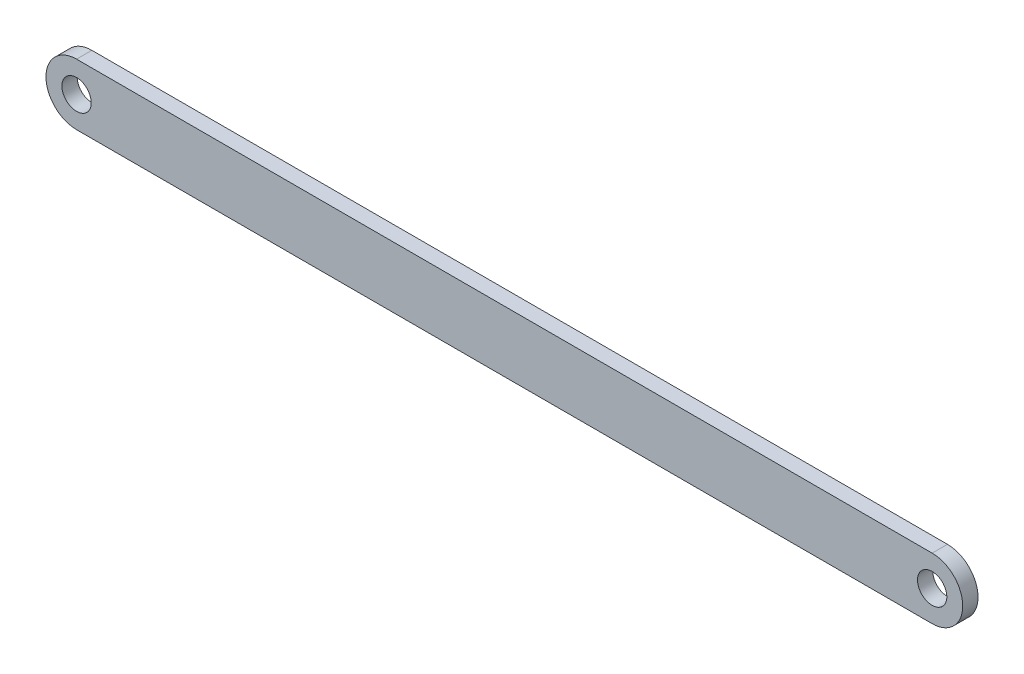
ISO-10303-21;
HEADER;
FILE_DESCRIPTION(('STEP AP214'),'2;1');
FILE_NAME('part.step','',(''),(''),'','','');
FILE_SCHEMA(('AUTOMOTIVE_DESIGN { 1 0 10303 214 1 1 1 1 }'));
ENDSEC;
DATA;
#1=APPLICATION_CONTEXT('core data for automotive mechanical design processes');
#2=APPLICATION_PROTOCOL_DEFINITION('international standard','automotive_design',2000,#1);
#3=PRODUCT_CONTEXT('',#1,'mechanical');
#4=PRODUCT('Part','Part','',(#3));
#5=PRODUCT_RELATED_PRODUCT_CATEGORY('part','',(#4));
#6=PRODUCT_DEFINITION_FORMATION('','',#4);
#7=PRODUCT_DEFINITION_CONTEXT('part definition',#1,'design');
#8=PRODUCT_DEFINITION('design','',#6,#7);
#9=PRODUCT_DEFINITION_SHAPE('','',#8);
#10=(LENGTH_UNIT() NAMED_UNIT(*) SI_UNIT(.MILLI.,.METRE.));
#11=(NAMED_UNIT(*) PLANE_ANGLE_UNIT() SI_UNIT($,.RADIAN.));
#12=(NAMED_UNIT(*) SI_UNIT($,.STERADIAN.) SOLID_ANGLE_UNIT());
#13=UNCERTAINTY_MEASURE_WITH_UNIT(LENGTH_MEASURE(1.E-05),#10,'distance_accuracy_value','');
#14=(GEOMETRIC_REPRESENTATION_CONTEXT(3) GLOBAL_UNCERTAINTY_ASSIGNED_CONTEXT((#13)) GLOBAL_UNIT_ASSIGNED_CONTEXT((#10,
#11,#12)) REPRESENTATION_CONTEXT('',''));
#15=CARTESIAN_POINT('',(0.,0.,0.));
#16=DIRECTION('',(0.,0.,1.));
#17=DIRECTION('',(1.,0.,0.));
#18=AXIS2_PLACEMENT_3D('',#15,#16,#17);
#19=CARTESIAN_POINT('',(88.9,0.,3.175));
#20=DIRECTION('',(0.,0.,-1.));
#21=DIRECTION('',(-1.,0.,0.));
#22=AXIS2_PLACEMENT_3D('',#19,#20,#21);
#23=PLANE('',#22);
#24=CARTESIAN_POINT('',(88.9,0.,3.175));
#25=DIRECTION('',(0.,0.,1.));
#26=DIRECTION('',(-1.,0.,0.));
#27=AXIS2_PLACEMENT_3D('',#24,#25,#26);
#28=CIRCLE('',#27,6.35);
#29=CARTESIAN_POINT('',(88.9,-6.35,3.175));
#30=VERTEX_POINT('',#29);
#31=CARTESIAN_POINT('',(88.9,6.35,3.175));
#32=VERTEX_POINT('',#31);
#33=EDGE_CURVE('E86',#30,#32,#28,.T.);
#34=ORIENTED_EDGE('',*,*,#33,.T.);
#35=DIRECTION('',(-1.,0.,0.));
#36=VECTOR('',#35,1.);
#37=CARTESIAN_POINT('',(-88.9,6.35,3.175));
#38=LINE('',#37,#36);
#39=CARTESIAN_POINT('',(-88.9,6.35,3.175));
#40=VERTEX_POINT('',#39);
#41=EDGE_CURVE('E81',#32,#40,#38,.T.);
#42=ORIENTED_EDGE('',*,*,#41,.T.);
#43=CARTESIAN_POINT('',(-88.9,0.,3.175));
#44=DIRECTION('',(0.,0.,1.));
#45=DIRECTION('',(1.,0.,0.));
#46=AXIS2_PLACEMENT_3D('',#43,#44,#45);
#47=CIRCLE('',#46,6.35);
#48=CARTESIAN_POINT('',(-88.9,-6.35,3.175));
#49=VERTEX_POINT('',#48);
#50=EDGE_CURVE('E84',#40,#49,#47,.T.);
#51=ORIENTED_EDGE('',*,*,#50,.T.);
#52=DIRECTION('',(1.,0.,0.));
#53=VECTOR('',#52,1.);
#54=CARTESIAN_POINT('',(-88.9,-6.35,3.175));
#55=LINE('',#54,#53);
#56=EDGE_CURVE('E51',#49,#30,#55,.T.);
#57=ORIENTED_EDGE('',*,*,#56,.T.);
#58=EDGE_LOOP('',(#34,#42,#51,#57));
#59=FACE_BOUND('',#58,.T.);
#60=CARTESIAN_POINT('',(-88.9,0.,3.175));
#61=DIRECTION('',(0.,0.,1.));
#62=DIRECTION('',(1.,0.,0.));
#63=AXIS2_PLACEMENT_3D('',#60,#61,#62);
#64=CIRCLE('',#63,3.048);
#65=CARTESIAN_POINT('',(-85.852,0.,3.175));
#66=VERTEX_POINT('',#65);
#67=EDGE_CURVE('E101',#66,#66,#64,.T.);
#68=ORIENTED_EDGE('',*,*,#67,.F.);
#69=EDGE_LOOP('',(#68));
#70=FACE_BOUND('',#69,.T.);
#71=CARTESIAN_POINT('',(88.9,0.,3.175));
#72=DIRECTION('',(0.,0.,1.));
#73=DIRECTION('',(1.,0.,0.));
#74=AXIS2_PLACEMENT_3D('',#71,#72,#73);
#75=CIRCLE('',#74,3.048);
#76=CARTESIAN_POINT('',(91.948,0.,3.175));
#77=VERTEX_POINT('',#76);
#78=EDGE_CURVE('E116',#77,#77,#75,.T.);
#79=ORIENTED_EDGE('',*,*,#78,.F.);
#80=EDGE_LOOP('',(#79));
#81=FACE_BOUND('',#80,.T.);
#82=ADVANCED_FACE('F34',(#59,#70,#81),#23,.F.);
#83=CARTESIAN_POINT('',(88.9,0.,0.));
#84=DIRECTION('',(0.,0.,-1.));
#85=DIRECTION('',(-1.,0.,0.));
#86=AXIS2_PLACEMENT_3D('',#83,#84,#85);
#87=PLANE('',#86);
#88=CARTESIAN_POINT('',(-88.9,0.,0.));
#89=DIRECTION('',(0.,0.,1.));
#90=DIRECTION('',(1.,0.,0.));
#91=AXIS2_PLACEMENT_3D('',#88,#89,#90);
#92=CIRCLE('',#91,3.048);
#93=CARTESIAN_POINT('',(-85.852,0.,0.));
#94=VERTEX_POINT('',#93);
#95=EDGE_CURVE('E113',#94,#94,#92,.T.);
#96=ORIENTED_EDGE('',*,*,#95,.T.);
#97=EDGE_LOOP('',(#96));
#98=FACE_BOUND('',#97,.T.);
#99=CARTESIAN_POINT('',(88.9,0.,0.));
#100=DIRECTION('',(0.,0.,1.));
#101=DIRECTION('',(-1.,0.,0.));
#102=AXIS2_PLACEMENT_3D('',#99,#100,#101);
#103=CIRCLE('',#102,6.35);
#104=CARTESIAN_POINT('',(88.9,-6.35,0.));
#105=VERTEX_POINT('',#104);
#106=CARTESIAN_POINT('',(88.9,6.35,0.));
#107=VERTEX_POINT('',#106);
#108=EDGE_CURVE('E98',#105,#107,#103,.T.);
#109=ORIENTED_EDGE('',*,*,#108,.F.);
#110=DIRECTION('',(1.,0.,0.));
#111=VECTOR('',#110,1.);
#112=CARTESIAN_POINT('',(-88.9,-6.35,0.));
#113=LINE('',#112,#111);
#114=CARTESIAN_POINT('',(-88.9,-6.35,0.));
#115=VERTEX_POINT('',#114);
#116=EDGE_CURVE('E74',#115,#105,#113,.T.);
#117=ORIENTED_EDGE('',*,*,#116,.F.);
#118=CARTESIAN_POINT('',(-88.9,0.,0.));
#119=DIRECTION('',(0.,0.,1.));
#120=DIRECTION('',(1.,0.,0.));
#121=AXIS2_PLACEMENT_3D('',#118,#119,#120);
#122=CIRCLE('',#121,6.35);
#123=CARTESIAN_POINT('',(-88.9,6.35,0.));
#124=VERTEX_POINT('',#123);
#125=EDGE_CURVE('E68',#124,#115,#122,.T.);
#126=ORIENTED_EDGE('',*,*,#125,.F.);
#127=DIRECTION('',(-1.,0.,0.));
#128=VECTOR('',#127,1.);
#129=CARTESIAN_POINT('',(-88.9,6.35,0.));
#130=LINE('',#129,#128);
#131=EDGE_CURVE('E90',#107,#124,#130,.T.);
#132=ORIENTED_EDGE('',*,*,#131,.F.);
#133=EDGE_LOOP('',(#109,#117,#126,#132));
#134=FACE_BOUND('',#133,.T.);
#135=CARTESIAN_POINT('',(88.9,0.,0.));
#136=DIRECTION('',(0.,0.,1.));
#137=DIRECTION('',(1.,0.,0.));
#138=AXIS2_PLACEMENT_3D('',#135,#136,#137);
#139=CIRCLE('',#138,3.048);
#140=CARTESIAN_POINT('',(91.948,0.,0.));
#141=VERTEX_POINT('',#140);
#142=EDGE_CURVE('E119',#141,#141,#139,.T.);
#143=ORIENTED_EDGE('',*,*,#142,.T.);
#144=EDGE_LOOP('',(#143));
#145=FACE_BOUND('',#144,.T.);
#146=ADVANCED_FACE('F109',(#98,#134,#145),#87,.T.);
#147=CARTESIAN_POINT('',(88.9,0.,3.175));
#148=DIRECTION('',(0.,0.,-1.));
#149=DIRECTION('',(-1.,0.,0.));
#150=AXIS2_PLACEMENT_3D('',#147,#148,#149);
#151=CYLINDRICAL_SURFACE('',#150,6.35);
#152=ORIENTED_EDGE('',*,*,#108,.T.);
#153=DIRECTION('',(0.,0.,-1.));
#154=VECTOR('',#153,1.);
#155=CARTESIAN_POINT('',(88.9,6.35,3.175));
#156=LINE('',#155,#154);
#157=EDGE_CURVE('E11',#32,#107,#156,.T.);
#158=ORIENTED_EDGE('',*,*,#157,.F.);
#159=ORIENTED_EDGE('',*,*,#33,.F.);
#160=DIRECTION('',(0.,0.,-1.));
#161=VECTOR('',#160,1.);
#162=CARTESIAN_POINT('',(88.9,-6.35,3.175));
#163=LINE('',#162,#161);
#164=EDGE_CURVE('E94',#30,#105,#163,.T.);
#165=ORIENTED_EDGE('',*,*,#164,.T.);
#166=EDGE_LOOP('',(#152,#158,#159,#165));
#167=FACE_BOUND('',#166,.T.);
#168=ADVANCED_FACE('F36',(#167),#151,.T.);
#169=CARTESIAN_POINT('',(-88.9,6.35,3.175));
#170=DIRECTION('',(0.,-1.,0.));
#171=DIRECTION('',(0.,0.,-1.));
#172=AXIS2_PLACEMENT_3D('',#169,#170,#171);
#173=PLANE('',#172);
#174=ORIENTED_EDGE('',*,*,#131,.T.);
#175=DIRECTION('',(0.,0.,-1.));
#176=VECTOR('',#175,1.);
#177=CARTESIAN_POINT('',(-88.9,6.35,3.175));
#178=LINE('',#177,#176);
#179=EDGE_CURVE('E43',#40,#124,#178,.T.);
#180=ORIENTED_EDGE('',*,*,#179,.F.);
#181=ORIENTED_EDGE('',*,*,#41,.F.);
#182=ORIENTED_EDGE('',*,*,#157,.T.);
#183=EDGE_LOOP('',(#174,#180,#181,#182));
#184=FACE_BOUND('',#183,.T.);
#185=ADVANCED_FACE('F89',(#184),#173,.F.);
#186=CARTESIAN_POINT('',(-88.9,0.,3.175));
#187=DIRECTION('',(0.,0.,-1.));
#188=DIRECTION('',(-1.,0.,0.));
#189=AXIS2_PLACEMENT_3D('',#186,#187,#188);
#190=CYLINDRICAL_SURFACE('',#189,6.35);
#191=ORIENTED_EDGE('',*,*,#125,.T.);
#192=DIRECTION('',(0.,0.,-1.));
#193=VECTOR('',#192,1.);
#194=CARTESIAN_POINT('',(-88.9,-6.35,3.175));
#195=LINE('',#194,#193);
#196=EDGE_CURVE('E91',#49,#115,#195,.T.);
#197=ORIENTED_EDGE('',*,*,#196,.F.);
#198=ORIENTED_EDGE('',*,*,#50,.F.);
#199=ORIENTED_EDGE('',*,*,#179,.T.);
#200=EDGE_LOOP('',(#191,#197,#198,#199));
#201=FACE_BOUND('',#200,.T.);
#202=ADVANCED_FACE('F92',(#201),#190,.T.);
#203=CARTESIAN_POINT('',(-88.9,-6.35,3.175));
#204=DIRECTION('',(0.,1.,0.));
#205=DIRECTION('',(0.,0.,1.));
#206=AXIS2_PLACEMENT_3D('',#203,#204,#205);
#207=PLANE('',#206);
#208=ORIENTED_EDGE('',*,*,#116,.T.);
#209=ORIENTED_EDGE('',*,*,#164,.F.);
#210=ORIENTED_EDGE('',*,*,#56,.F.);
#211=ORIENTED_EDGE('',*,*,#196,.T.);
#212=EDGE_LOOP('',(#208,#209,#210,#211));
#213=FACE_BOUND('',#212,.T.);
#214=ADVANCED_FACE('F106',(#213),#207,.F.);
#215=CARTESIAN_POINT('',(-88.9,0.,3.175));
#216=DIRECTION('',(0.,0.,-1.));
#217=DIRECTION('',(-1.,0.,0.));
#218=AXIS2_PLACEMENT_3D('',#215,#216,#217);
#219=CYLINDRICAL_SURFACE('',#218,3.048);
#220=ORIENTED_EDGE('',*,*,#67,.T.);
#221=EDGE_LOOP('',(#220));
#222=FACE_BOUND('',#221,.T.);
#223=ORIENTED_EDGE('',*,*,#95,.F.);
#224=EDGE_LOOP('',(#223));
#225=FACE_BOUND('',#224,.T.);
#226=ADVANCED_FACE('F136',(#222,#225),#219,.F.);
#227=CARTESIAN_POINT('',(88.9,0.,3.175));
#228=DIRECTION('',(0.,0.,-1.));
#229=DIRECTION('',(-1.,0.,0.));
#230=AXIS2_PLACEMENT_3D('',#227,#228,#229);
#231=CYLINDRICAL_SURFACE('',#230,3.048);
#232=ORIENTED_EDGE('',*,*,#78,.T.);
#233=EDGE_LOOP('',(#232));
#234=FACE_BOUND('',#233,.T.);
#235=ORIENTED_EDGE('',*,*,#142,.F.);
#236=EDGE_LOOP('',(#235));
#237=FACE_BOUND('',#236,.T.);
#238=ADVANCED_FACE('F125',(#234,#237),#231,.F.);
#239=CLOSED_SHELL('',(#82,#146,#168,#185,#202,#214,#226,#238));
#240=MANIFOLD_SOLID_BREP('B2',#239);
#241=ADVANCED_BREP_SHAPE_REPRESENTATION('',(#18,#240),#14);
#242=SHAPE_DEFINITION_REPRESENTATION(#9,#241);
ENDSEC;
END-ISO-10303-21;
